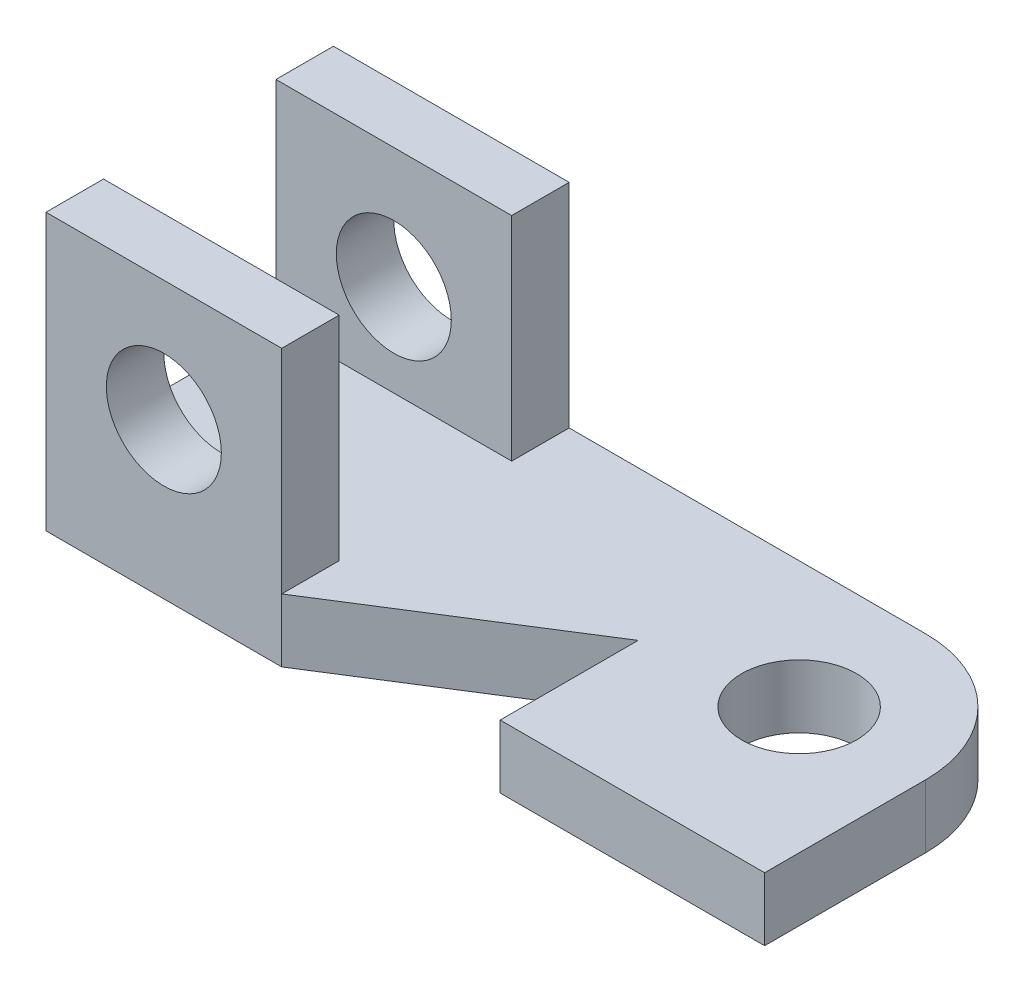
ISO-10303-21;
HEADER;
FILE_DESCRIPTION(('STEP AP214'),'2;1');
FILE_NAME('part.step','',(''),(''),'','','');
FILE_SCHEMA(('AUTOMOTIVE_DESIGN { 1 0 10303 214 1 1 1 1 }'));
ENDSEC;
DATA;
#1=APPLICATION_CONTEXT('core data for automotive mechanical design processes');
#2=APPLICATION_PROTOCOL_DEFINITION('international standard','automotive_design',2000,#1);
#3=PRODUCT_CONTEXT('',#1,'mechanical');
#4=PRODUCT('Part','Part','',(#3));
#5=PRODUCT_RELATED_PRODUCT_CATEGORY('part','',(#4));
#6=PRODUCT_DEFINITION_FORMATION('','',#4);
#7=PRODUCT_DEFINITION_CONTEXT('part definition',#1,'design');
#8=PRODUCT_DEFINITION('design','',#6,#7);
#9=PRODUCT_DEFINITION_SHAPE('','',#8);
#10=(LENGTH_UNIT() NAMED_UNIT(*) SI_UNIT(.MILLI.,.METRE.));
#11=(NAMED_UNIT(*) PLANE_ANGLE_UNIT() SI_UNIT($,.RADIAN.));
#12=(NAMED_UNIT(*) SI_UNIT($,.STERADIAN.) SOLID_ANGLE_UNIT());
#13=UNCERTAINTY_MEASURE_WITH_UNIT(LENGTH_MEASURE(1.E-05),#10,'distance_accuracy_value','');
#14=(GEOMETRIC_REPRESENTATION_CONTEXT(3) GLOBAL_UNCERTAINTY_ASSIGNED_CONTEXT((#13)) GLOBAL_UNIT_ASSIGNED_CONTEXT((#10,
#11,#12)) REPRESENTATION_CONTEXT('',''));
#15=CARTESIAN_POINT('',(0.,0.,0.));
#16=DIRECTION('',(0.,0.,1.));
#17=DIRECTION('',(1.,0.,0.));
#18=AXIS2_PLACEMENT_3D('',#15,#16,#17);
#19=CARTESIAN_POINT('',(-220.,110.,-280.));
#20=DIRECTION('',(0.,-1.,0.));
#21=DIRECTION('',(0.,0.,-1.));
#22=AXIS2_PLACEMENT_3D('',#19,#20,#21);
#23=PLANE('',#22);
#24=CARTESIAN_POINT('',(-220.,110.,-280.));
#25=DIRECTION('',(0.,1.,0.));
#26=DIRECTION('',(0.,0.,1.));
#27=AXIS2_PLACEMENT_3D('',#24,#25,#26);
#28=CIRCLE('',#27,100.);
#29=CARTESIAN_POINT('',(-220.,110.,-180.));
#30=VERTEX_POINT('',#29);
#31=EDGE_CURVE('E221',#30,#30,#28,.T.);
#32=ORIENTED_EDGE('',*,*,#31,.F.);
#33=EDGE_LOOP('',(#32));
#34=FACE_BOUND('',#33,.T.);
#35=DIRECTION('',(1.,0.,0.));
#36=VECTOR('',#35,1.);
#37=CARTESIAN_POINT('',(0.,110.,-99.9999999999999));
#38=LINE('',#37,#36);
#39=CARTESIAN_POINT('',(-1250.,110.,-99.9999999999999));
#40=VERTEX_POINT('',#39);
#41=CARTESIAN_POINT('',(-840.,110.,-99.9999999999999));
#42=VERTEX_POINT('',#41);
#43=EDGE_CURVE('E183',#40,#42,#38,.T.);
#44=ORIENTED_EDGE('',*,*,#43,.T.);
#45=DIRECTION('',(0.,0.,1.));
#46=VECTOR('',#45,1.);
#47=CARTESIAN_POINT('',(-840.,110.,0.));
#48=LINE('',#47,#46);
#49=CARTESIAN_POINT('',(-840.,110.,1.66533453693773E-13));
#50=VERTEX_POINT('',#49);
#51=EDGE_CURVE('E167',#42,#50,#48,.T.);
#52=ORIENTED_EDGE('',*,*,#51,.T.);
#53=DIRECTION('',(-0.845488903030971,0.,0.533992991387982));
#54=VECTOR('',#53,1.);
#55=CARTESIAN_POINT('',(-460.,110.,-240.));
#56=LINE('',#55,#54);
#57=CARTESIAN_POINT('',(-460.,110.,-240.));
#58=VERTEX_POINT('',#57);
#59=EDGE_CURVE('E234',#58,#50,#56,.T.);
#60=ORIENTED_EDGE('',*,*,#59,.F.);
#61=DIRECTION('',(0.,0.,-1.));
#62=VECTOR('',#61,1.);
#63=CARTESIAN_POINT('',(-460.,110.,0.));
#64=LINE('',#63,#62);
#65=CARTESIAN_POINT('',(-460.,110.,0.));
#66=VERTEX_POINT('',#65);
#67=EDGE_CURVE('E230',#66,#58,#64,.T.);
#68=ORIENTED_EDGE('',*,*,#67,.F.);
#69=DIRECTION('',(-1.,0.,0.));
#70=VECTOR('',#69,1.);
#71=CARTESIAN_POINT('',(0.,110.,0.));
#72=LINE('',#71,#70);
#73=CARTESIAN_POINT('',(0.,110.,0.));
#74=VERTEX_POINT('',#73);
#75=EDGE_CURVE('E227',#74,#66,#72,.T.);
#76=ORIENTED_EDGE('',*,*,#75,.F.);
#77=DIRECTION('',(0.,0.,-1.));
#78=VECTOR('',#77,1.);
#79=CARTESIAN_POINT('',(0.,110.,0.));
#80=LINE('',#79,#78);
#81=CARTESIAN_POINT('',(0.,110.,-280.));
#82=VERTEX_POINT('',#81);
#83=EDGE_CURVE('E243',#74,#82,#80,.T.);
#84=ORIENTED_EDGE('',*,*,#83,.T.);
#85=CARTESIAN_POINT('',(-220.,110.,-280.));
#86=DIRECTION('',(0.,-1.,0.));
#87=DIRECTION('',(0.,0.,-1.));
#88=AXIS2_PLACEMENT_3D('',#85,#86,#87);
#89=CIRCLE('',#88,220.);
#90=CARTESIAN_POINT('',(-220.,110.,-500.));
#91=VERTEX_POINT('',#90);
#92=EDGE_CURVE('E240',#91,#82,#89,.T.);
#93=ORIENTED_EDGE('',*,*,#92,.F.);
#94=DIRECTION('',(-1.,0.,0.));
#95=VECTOR('',#94,1.);
#96=CARTESIAN_POINT('',(-220.,110.,-500.));
#97=LINE('',#96,#95);
#98=CARTESIAN_POINT('',(-840.,110.,-500.));
#99=VERTEX_POINT('',#98);
#100=EDGE_CURVE('E238',#91,#99,#97,.T.);
#101=ORIENTED_EDGE('',*,*,#100,.T.);
#102=DIRECTION('',(0.,0.,-1.));
#103=VECTOR('',#102,1.);
#104=CARTESIAN_POINT('',(-840.,110.,0.));
#105=LINE('',#104,#103);
#106=CARTESIAN_POINT('',(-840.,110.,-400.));
#107=VERTEX_POINT('',#106);
#108=EDGE_CURVE('E79',#107,#99,#105,.T.);
#109=ORIENTED_EDGE('',*,*,#108,.F.);
#110=DIRECTION('',(1.,0.,0.));
#111=VECTOR('',#110,1.);
#112=CARTESIAN_POINT('',(0.,110.,-400.));
#113=LINE('',#112,#111);
#114=CARTESIAN_POINT('',(-1250.,110.,-400.));
#115=VERTEX_POINT('',#114);
#116=EDGE_CURVE('E172',#115,#107,#113,.T.);
#117=ORIENTED_EDGE('',*,*,#116,.F.);
#118=DIRECTION('',(0.,0.,-1.));
#119=VECTOR('',#118,1.);
#120=CARTESIAN_POINT('',(-1250.,110.,1.53080849893419E-13));
#121=LINE('',#120,#119);
#122=EDGE_CURVE('E87',#40,#115,#121,.T.);
#123=ORIENTED_EDGE('',*,*,#122,.F.);
#124=EDGE_LOOP('',(#44,#52,#60,#68,#76,#84,#93,#101,#109,#117,#123));
#125=FACE_BOUND('',#124,.T.);
#126=ADVANCED_FACE('F62',(#34,#125),#23,.F.);
#127=CARTESIAN_POINT('',(-220.,0.,-280.));
#128=DIRECTION('',(0.,-1.,0.));
#129=DIRECTION('',(0.,0.,-1.));
#130=AXIS2_PLACEMENT_3D('',#127,#128,#129);
#131=PLANE('',#130);
#132=DIRECTION('',(-1.,0.,0.));
#133=VECTOR('',#132,1.);
#134=CARTESIAN_POINT('',(0.,0.,0.));
#135=LINE('',#134,#133);
#136=CARTESIAN_POINT('',(0.,0.,0.));
#137=VERTEX_POINT('',#136);
#138=CARTESIAN_POINT('',(-460.,0.,0.));
#139=VERTEX_POINT('',#138);
#140=EDGE_CURVE('E224',#137,#139,#135,.T.);
#141=ORIENTED_EDGE('',*,*,#140,.T.);
#142=DIRECTION('',(0.,0.,-1.));
#143=VECTOR('',#142,1.);
#144=CARTESIAN_POINT('',(-460.,0.,0.));
#145=LINE('',#144,#143);
#146=CARTESIAN_POINT('',(-460.,0.,-240.));
#147=VERTEX_POINT('',#146);
#148=EDGE_CURVE('E248',#139,#147,#145,.T.);
#149=ORIENTED_EDGE('',*,*,#148,.T.);
#150=DIRECTION('',(-0.845488903030971,0.,0.533992991387982));
#151=VECTOR('',#150,1.);
#152=CARTESIAN_POINT('',(-460.,0.,-240.));
#153=LINE('',#152,#151);
#154=CARTESIAN_POINT('',(-840.,0.,1.02870331128378E-13));
#155=VERTEX_POINT('',#154);
#156=EDGE_CURVE('E251',#147,#155,#153,.T.);
#157=ORIENTED_EDGE('',*,*,#156,.T.);
#158=DIRECTION('',(-1.,0.,0.));
#159=VECTOR('',#158,1.);
#160=CARTESIAN_POINT('',(-840.,0.,1.02870331128378E-13));
#161=LINE('',#160,#159);
#162=CARTESIAN_POINT('',(-1250.,0.,1.53080849893419E-13));
#163=VERTEX_POINT('',#162);
#164=EDGE_CURVE('E254',#155,#163,#161,.T.);
#165=ORIENTED_EDGE('',*,*,#164,.T.);
#166=DIRECTION('',(0.,0.,-1.));
#167=VECTOR('',#166,1.);
#168=CARTESIAN_POINT('',(-1250.,0.,1.53080849893419E-13));
#169=LINE('',#168,#167);
#170=CARTESIAN_POINT('',(-1250.,0.,-500.));
#171=VERTEX_POINT('',#170);
#172=EDGE_CURVE('E257',#163,#171,#169,.T.);
#173=ORIENTED_EDGE('',*,*,#172,.T.);
#174=DIRECTION('',(-1.,0.,0.));
#175=VECTOR('',#174,1.);
#176=CARTESIAN_POINT('',(-220.,0.,-500.));
#177=LINE('',#176,#175);
#178=CARTESIAN_POINT('',(-220.,0.,-500.));
#179=VERTEX_POINT('',#178);
#180=EDGE_CURVE('E260',#179,#171,#177,.T.);
#181=ORIENTED_EDGE('',*,*,#180,.F.);
#182=CARTESIAN_POINT('',(-220.,0.,-280.));
#183=DIRECTION('',(0.,-1.,0.));
#184=DIRECTION('',(0.,0.,-1.));
#185=AXIS2_PLACEMENT_3D('',#182,#183,#184);
#186=CIRCLE('',#185,220.);
#187=CARTESIAN_POINT('',(0.,0.,-280.));
#188=VERTEX_POINT('',#187);
#189=EDGE_CURVE('E263',#179,#188,#186,.T.);
#190=ORIENTED_EDGE('',*,*,#189,.T.);
#191=DIRECTION('',(0.,0.,-1.));
#192=VECTOR('',#191,1.);
#193=CARTESIAN_POINT('',(0.,0.,0.));
#194=LINE('',#193,#192);
#195=EDGE_CURVE('E231',#137,#188,#194,.T.);
#196=ORIENTED_EDGE('',*,*,#195,.F.);
#197=EDGE_LOOP('',(#141,#149,#157,#165,#173,#181,#190,#196));
#198=FACE_BOUND('',#197,.T.);
#199=CARTESIAN_POINT('',(-220.,0.,-280.));
#200=DIRECTION('',(0.,1.,0.));
#201=DIRECTION('',(0.,0.,1.));
#202=AXIS2_PLACEMENT_3D('',#199,#200,#201);
#203=CIRCLE('',#202,100.);
#204=CARTESIAN_POINT('',(-220.,0.,-180.));
#205=VERTEX_POINT('',#204);
#206=EDGE_CURVE('E220',#205,#205,#203,.T.);
#207=ORIENTED_EDGE('',*,*,#206,.T.);
#208=EDGE_LOOP('',(#207));
#209=FACE_BOUND('',#208,.T.);
#210=ADVANCED_FACE('F288',(#198,#209),#131,.T.);
#211=CARTESIAN_POINT('',(0.,110.,0.));
#212=DIRECTION('',(0.,0.,1.));
#213=DIRECTION('',(1.,0.,0.));
#214=AXIS2_PLACEMENT_3D('',#211,#212,#213);
#215=PLANE('',#214);
#216=ORIENTED_EDGE('',*,*,#140,.F.);
#217=DIRECTION('',(0.,-1.,0.));
#218=VECTOR('',#217,1.);
#219=CARTESIAN_POINT('',(0.,110.,0.));
#220=LINE('',#219,#218);
#221=EDGE_CURVE('E12',#74,#137,#220,.T.);
#222=ORIENTED_EDGE('',*,*,#221,.F.);
#223=ORIENTED_EDGE('',*,*,#75,.T.);
#224=DIRECTION('',(0.,-1.,0.));
#225=VECTOR('',#224,1.);
#226=CARTESIAN_POINT('',(-460.,110.,0.));
#227=LINE('',#226,#225);
#228=EDGE_CURVE('E245',#66,#139,#227,.T.);
#229=ORIENTED_EDGE('',*,*,#228,.T.);
#230=EDGE_LOOP('',(#216,#222,#223,#229));
#231=FACE_BOUND('',#230,.T.);
#232=ADVANCED_FACE('F64',(#231),#215,.T.);
#233=CARTESIAN_POINT('',(0.,110.,0.));
#234=DIRECTION('',(-1.,0.,0.));
#235=DIRECTION('',(0.,0.,1.));
#236=AXIS2_PLACEMENT_3D('',#233,#234,#235);
#237=PLANE('',#236);
#238=ORIENTED_EDGE('',*,*,#195,.T.);
#239=DIRECTION('',(0.,-1.,0.));
#240=VECTOR('',#239,1.);
#241=CARTESIAN_POINT('',(0.,110.,-280.));
#242=LINE('',#241,#240);
#243=EDGE_CURVE('E71',#82,#188,#242,.T.);
#244=ORIENTED_EDGE('',*,*,#243,.F.);
#245=ORIENTED_EDGE('',*,*,#83,.F.);
#246=ORIENTED_EDGE('',*,*,#221,.T.);
#247=EDGE_LOOP('',(#238,#244,#245,#246));
#248=FACE_BOUND('',#247,.T.);
#249=ADVANCED_FACE('F294',(#248),#237,.F.);
#250=CARTESIAN_POINT('',(-220.,110.,-280.));
#251=DIRECTION('',(0.,-1.,0.));
#252=DIRECTION('',(0.,0.,-1.));
#253=AXIS2_PLACEMENT_3D('',#250,#251,#252);
#254=CYLINDRICAL_SURFACE('',#253,220.);
#255=ORIENTED_EDGE('',*,*,#189,.F.);
#256=DIRECTION('',(0.,-1.,0.));
#257=VECTOR('',#256,1.);
#258=CARTESIAN_POINT('',(-220.,110.,-500.));
#259=LINE('',#258,#257);
#260=EDGE_CURVE('E269',#91,#179,#259,.T.);
#261=ORIENTED_EDGE('',*,*,#260,.F.);
#262=ORIENTED_EDGE('',*,*,#92,.T.);
#263=ORIENTED_EDGE('',*,*,#243,.T.);
#264=EDGE_LOOP('',(#255,#261,#262,#263));
#265=FACE_BOUND('',#264,.T.);
#266=ADVANCED_FACE('F312',(#265),#254,.T.);
#267=CARTESIAN_POINT('',(-220.,110.,-500.));
#268=DIRECTION('',(0.,0.,1.));
#269=DIRECTION('',(1.,0.,0.));
#270=AXIS2_PLACEMENT_3D('',#267,#268,#269);
#271=PLANE('',#270);
#272=CARTESIAN_POINT('',(-1045.,270.,-500.));
#273=DIRECTION('',(0.,0.,1.));
#274=DIRECTION('',(1.,0.,0.));
#275=AXIS2_PLACEMENT_3D('',#272,#273,#274);
#276=CIRCLE('',#275,100.);
#277=CARTESIAN_POINT('',(-945.,270.,-500.));
#278=VERTEX_POINT('',#277);
#279=EDGE_CURVE('E464',#278,#278,#276,.T.);
#280=ORIENTED_EDGE('',*,*,#279,.T.);
#281=EDGE_LOOP('',(#280));
#282=FACE_BOUND('',#281,.T.);
#283=ORIENTED_EDGE('',*,*,#180,.T.);
#284=DIRECTION('',(0.,-1.,0.));
#285=VECTOR('',#284,1.);
#286=CARTESIAN_POINT('',(-1250.,110.,-500.));
#287=LINE('',#286,#285);
#288=CARTESIAN_POINT('',(-1250.,480.,-500.));
#289=VERTEX_POINT('',#288);
#290=EDGE_CURVE('E271',#289,#171,#287,.T.);
#291=ORIENTED_EDGE('',*,*,#290,.F.);
#292=DIRECTION('',(-1.,0.,0.));
#293=VECTOR('',#292,1.);
#294=CARTESIAN_POINT('',(0.,480.,-500.));
#295=LINE('',#294,#293);
#296=CARTESIAN_POINT('',(-840.,480.,-500.));
#297=VERTEX_POINT('',#296);
#298=EDGE_CURVE('E204',#297,#289,#295,.T.);
#299=ORIENTED_EDGE('',*,*,#298,.F.);
#300=DIRECTION('',(0.,-1.,0.));
#301=VECTOR('',#300,1.);
#302=CARTESIAN_POINT('',(-840.,480.,-500.));
#303=LINE('',#302,#301);
#304=EDGE_CURVE('E215',#297,#99,#303,.T.);
#305=ORIENTED_EDGE('',*,*,#304,.T.);
#306=ORIENTED_EDGE('',*,*,#100,.F.);
#307=ORIENTED_EDGE('',*,*,#260,.T.);
#308=EDGE_LOOP('',(#283,#291,#299,#305,#306,#307));
#309=FACE_BOUND('',#308,.T.);
#310=ADVANCED_FACE('F309',(#282,#309),#271,.F.);
#311=CARTESIAN_POINT('',(-1250.,110.,1.53080849893419E-13));
#312=DIRECTION('',(-1.,0.,0.));
#313=DIRECTION('',(0.,0.,1.));
#314=AXIS2_PLACEMENT_3D('',#311,#312,#313);
#315=PLANE('',#314);
#316=ORIENTED_EDGE('',*,*,#172,.F.);
#317=DIRECTION('',(0.,-1.,0.));
#318=VECTOR('',#317,1.);
#319=CARTESIAN_POINT('',(-1250.,110.,1.53080849893419E-13));
#320=LINE('',#319,#318);
#321=CARTESIAN_POINT('',(-1250.,480.,1.53080849893419E-13));
#322=VERTEX_POINT('',#321);
#323=EDGE_CURVE('E273',#322,#163,#320,.T.);
#324=ORIENTED_EDGE('',*,*,#323,.F.);
#325=DIRECTION('',(0.,0.,1.));
#326=VECTOR('',#325,1.);
#327=CARTESIAN_POINT('',(-1250.,480.,0.));
#328=LINE('',#327,#326);
#329=CARTESIAN_POINT('',(-1250.,480.,-99.9999999999999));
#330=VERTEX_POINT('',#329);
#331=EDGE_CURVE('E187',#330,#322,#328,.T.);
#332=ORIENTED_EDGE('',*,*,#331,.F.);
#333=DIRECTION('',(0.,-1.,0.));
#334=VECTOR('',#333,1.);
#335=CARTESIAN_POINT('',(-1250.,480.,-99.9999999999999));
#336=LINE('',#335,#334);
#337=EDGE_CURVE('E173',#330,#40,#336,.T.);
#338=ORIENTED_EDGE('',*,*,#337,.T.);
#339=ORIENTED_EDGE('',*,*,#122,.T.);
#340=DIRECTION('',(0.,-1.,0.));
#341=VECTOR('',#340,1.);
#342=CARTESIAN_POINT('',(-1250.,480.,-400.));
#343=LINE('',#342,#341);
#344=CARTESIAN_POINT('',(-1250.,480.,-400.));
#345=VERTEX_POINT('',#344);
#346=EDGE_CURVE('E209',#345,#115,#343,.T.);
#347=ORIENTED_EDGE('',*,*,#346,.F.);
#348=DIRECTION('',(0.,0.,1.));
#349=VECTOR('',#348,1.);
#350=CARTESIAN_POINT('',(-1250.,480.,0.));
#351=LINE('',#350,#349);
#352=EDGE_CURVE('E207',#289,#345,#351,.T.);
#353=ORIENTED_EDGE('',*,*,#352,.F.);
#354=ORIENTED_EDGE('',*,*,#290,.T.);
#355=EDGE_LOOP('',(#316,#324,#332,#338,#339,#347,#353,#354));
#356=FACE_BOUND('',#355,.T.);
#357=ADVANCED_FACE('F305',(#356),#315,.T.);
#358=CARTESIAN_POINT('',(-840.,110.,1.02870331128378E-13));
#359=DIRECTION('',(0.,0.,1.));
#360=DIRECTION('',(1.,0.,0.));
#361=AXIS2_PLACEMENT_3D('',#358,#359,#360);
#362=PLANE('',#361);
#363=CARTESIAN_POINT('',(-1045.,270.,0.));
#364=DIRECTION('',(0.,0.,1.));
#365=DIRECTION('',(1.,0.,0.));
#366=AXIS2_PLACEMENT_3D('',#363,#364,#365);
#367=CIRCLE('',#366,100.);
#368=CARTESIAN_POINT('',(-945.,270.,0.));
#369=VERTEX_POINT('',#368);
#370=EDGE_CURVE('E468',#369,#369,#367,.T.);
#371=ORIENTED_EDGE('',*,*,#370,.F.);
#372=EDGE_LOOP('',(#371));
#373=FACE_BOUND('',#372,.T.);
#374=ORIENTED_EDGE('',*,*,#164,.F.);
#375=DIRECTION('',(0.,-1.,0.));
#376=VECTOR('',#375,1.);
#377=CARTESIAN_POINT('',(-840.,110.,1.02870331128378E-13));
#378=LINE('',#377,#376);
#379=EDGE_CURVE('E275',#50,#155,#378,.T.);
#380=ORIENTED_EDGE('',*,*,#379,.F.);
#381=DIRECTION('',(0.,-1.,0.));
#382=VECTOR('',#381,1.);
#383=CARTESIAN_POINT('',(-840.,480.,1.66533453693773E-13));
#384=LINE('',#383,#382);
#385=CARTESIAN_POINT('',(-840.,480.,1.66533453693773E-13));
#386=VERTEX_POINT('',#385);
#387=EDGE_CURVE('E193',#386,#50,#384,.T.);
#388=ORIENTED_EDGE('',*,*,#387,.F.);
#389=DIRECTION('',(1.,0.,0.));
#390=VECTOR('',#389,1.);
#391=CARTESIAN_POINT('',(0.,480.,0.));
#392=LINE('',#391,#390);
#393=EDGE_CURVE('E181',#322,#386,#392,.T.);
#394=ORIENTED_EDGE('',*,*,#393,.F.);
#395=ORIENTED_EDGE('',*,*,#323,.T.);
#396=EDGE_LOOP('',(#374,#380,#388,#394,#395));
#397=FACE_BOUND('',#396,.T.);
#398=ADVANCED_FACE('F304',(#373,#397),#362,.T.);
#399=CARTESIAN_POINT('',(-460.,110.,-240.));
#400=DIRECTION('',(0.533992991387982,0.,0.845488903030971));
#401=DIRECTION('',(0.845488903030971,0.,-0.533992991387982));
#402=AXIS2_PLACEMENT_3D('',#399,#400,#401);
#403=PLANE('',#402);
#404=ORIENTED_EDGE('',*,*,#156,.F.);
#405=DIRECTION('',(0.,-1.,0.));
#406=VECTOR('',#405,1.);
#407=CARTESIAN_POINT('',(-460.,110.,-240.));
#408=LINE('',#407,#406);
#409=EDGE_CURVE('E277',#58,#147,#408,.T.);
#410=ORIENTED_EDGE('',*,*,#409,.F.);
#411=ORIENTED_EDGE('',*,*,#59,.T.);
#412=ORIENTED_EDGE('',*,*,#379,.T.);
#413=EDGE_LOOP('',(#404,#410,#411,#412));
#414=FACE_BOUND('',#413,.T.);
#415=ADVANCED_FACE('F300',(#414),#403,.T.);
#416=CARTESIAN_POINT('',(-460.,110.,0.));
#417=DIRECTION('',(-1.,0.,0.));
#418=DIRECTION('',(0.,0.,1.));
#419=AXIS2_PLACEMENT_3D('',#416,#417,#418);
#420=PLANE('',#419);
#421=ORIENTED_EDGE('',*,*,#148,.F.);
#422=ORIENTED_EDGE('',*,*,#228,.F.);
#423=ORIENTED_EDGE('',*,*,#67,.T.);
#424=ORIENTED_EDGE('',*,*,#409,.T.);
#425=EDGE_LOOP('',(#421,#422,#423,#424));
#426=FACE_BOUND('',#425,.T.);
#427=ADVANCED_FACE('F284',(#426),#420,.T.);
#428=CARTESIAN_POINT('',(-220.,110.,-280.));
#429=DIRECTION('',(0.,-1.,0.));
#430=DIRECTION('',(0.,0.,-1.));
#431=AXIS2_PLACEMENT_3D('',#428,#429,#430);
#432=CYLINDRICAL_SURFACE('',#431,100.);
#433=ORIENTED_EDGE('',*,*,#31,.T.);
#434=EDGE_LOOP('',(#433));
#435=FACE_BOUND('',#434,.T.);
#436=ORIENTED_EDGE('',*,*,#206,.F.);
#437=EDGE_LOOP('',(#436));
#438=FACE_BOUND('',#437,.T.);
#439=ADVANCED_FACE('F323',(#435,#438),#432,.F.);
#440=CARTESIAN_POINT('',(0.,480.,-400.));
#441=DIRECTION('',(0.,0.,-1.));
#442=DIRECTION('',(-1.,0.,0.));
#443=AXIS2_PLACEMENT_3D('',#440,#441,#442);
#444=PLANE('',#443);
#445=CARTESIAN_POINT('',(-1045.,270.,-400.));
#446=DIRECTION('',(0.,0.,-1.));
#447=DIRECTION('',(-1.,0.,0.));
#448=AXIS2_PLACEMENT_3D('',#445,#446,#447);
#449=CIRCLE('',#448,100.);
#450=CARTESIAN_POINT('',(-1145.,270.,-400.));
#451=VERTEX_POINT('',#450);
#452=EDGE_CURVE('E195',#451,#451,#449,.T.);
#453=ORIENTED_EDGE('',*,*,#452,.T.);
#454=EDGE_LOOP('',(#453));
#455=FACE_BOUND('',#454,.T.);
#456=ORIENTED_EDGE('',*,*,#116,.T.);
#457=DIRECTION('',(0.,-1.,0.));
#458=VECTOR('',#457,1.);
#459=CARTESIAN_POINT('',(-840.,480.,-400.));
#460=LINE('',#459,#458);
#461=CARTESIAN_POINT('',(-840.,480.,-400.));
#462=VERTEX_POINT('',#461);
#463=EDGE_CURVE('E218',#462,#107,#460,.T.);
#464=ORIENTED_EDGE('',*,*,#463,.F.);
#465=DIRECTION('',(1.,0.,0.));
#466=VECTOR('',#465,1.);
#467=CARTESIAN_POINT('',(0.,480.,-400.));
#468=LINE('',#467,#466);
#469=EDGE_CURVE('E199',#345,#462,#468,.T.);
#470=ORIENTED_EDGE('',*,*,#469,.F.);
#471=ORIENTED_EDGE('',*,*,#346,.T.);
#472=EDGE_LOOP('',(#456,#464,#470,#471));
#473=FACE_BOUND('',#472,.T.);
#474=ADVANCED_FACE('F321',(#455,#473),#444,.F.);
#475=CARTESIAN_POINT('',(-840.,480.,0.));
#476=DIRECTION('',(-1.,0.,0.));
#477=DIRECTION('',(0.,0.,1.));
#478=AXIS2_PLACEMENT_3D('',#475,#476,#477);
#479=PLANE('',#478);
#480=ORIENTED_EDGE('',*,*,#108,.T.);
#481=ORIENTED_EDGE('',*,*,#304,.F.);
#482=DIRECTION('',(0.,0.,-1.));
#483=VECTOR('',#482,1.);
#484=CARTESIAN_POINT('',(-840.,480.,0.));
#485=LINE('',#484,#483);
#486=EDGE_CURVE('E202',#462,#297,#485,.T.);
#487=ORIENTED_EDGE('',*,*,#486,.F.);
#488=ORIENTED_EDGE('',*,*,#463,.T.);
#489=EDGE_LOOP('',(#480,#481,#487,#488));
#490=FACE_BOUND('',#489,.T.);
#491=ADVANCED_FACE('F315',(#490),#479,.F.);
#492=CARTESIAN_POINT('',(0.,480.,0.));
#493=DIRECTION('',(0.,1.,0.));
#494=DIRECTION('',(0.,0.,1.));
#495=AXIS2_PLACEMENT_3D('',#492,#493,#494);
#496=PLANE('',#495);
#497=ORIENTED_EDGE('',*,*,#469,.T.);
#498=ORIENTED_EDGE('',*,*,#486,.T.);
#499=ORIENTED_EDGE('',*,*,#298,.T.);
#500=ORIENTED_EDGE('',*,*,#352,.T.);
#501=EDGE_LOOP('',(#497,#498,#499,#500));
#502=FACE_BOUND('',#501,.T.);
#503=ADVANCED_FACE('F318',(#502),#496,.T.);
#504=CARTESIAN_POINT('',(-840.,480.,0.));
#505=DIRECTION('',(1.,0.,0.));
#506=DIRECTION('',(0.,0.,-1.));
#507=AXIS2_PLACEMENT_3D('',#504,#505,#506);
#508=PLANE('',#507);
#509=ORIENTED_EDGE('',*,*,#51,.F.);
#510=DIRECTION('',(0.,-1.,0.));
#511=VECTOR('',#510,1.);
#512=CARTESIAN_POINT('',(-840.,480.,-99.9999999999999));
#513=LINE('',#512,#511);
#514=CARTESIAN_POINT('',(-840.,480.,-99.9999999999999));
#515=VERTEX_POINT('',#514);
#516=EDGE_CURVE('E162',#515,#42,#513,.T.);
#517=ORIENTED_EDGE('',*,*,#516,.F.);
#518=DIRECTION('',(0.,0.,1.));
#519=VECTOR('',#518,1.);
#520=CARTESIAN_POINT('',(-840.,480.,0.));
#521=LINE('',#520,#519);
#522=EDGE_CURVE('E165',#515,#386,#521,.T.);
#523=ORIENTED_EDGE('',*,*,#522,.T.);
#524=ORIENTED_EDGE('',*,*,#387,.T.);
#525=EDGE_LOOP('',(#509,#517,#523,#524));
#526=FACE_BOUND('',#525,.T.);
#527=ADVANCED_FACE('F164',(#526),#508,.T.);
#528=CARTESIAN_POINT('',(0.,480.,-99.9999999999999));
#529=DIRECTION('',(0.,0.,-1.));
#530=DIRECTION('',(-1.,0.,0.));
#531=AXIS2_PLACEMENT_3D('',#528,#529,#530);
#532=PLANE('',#531);
#533=CARTESIAN_POINT('',(-1045.,270.,-99.9999999999999));
#534=DIRECTION('',(0.,0.,-1.));
#535=DIRECTION('',(-1.,0.,0.));
#536=AXIS2_PLACEMENT_3D('',#533,#534,#535);
#537=CIRCLE('',#536,100.);
#538=CARTESIAN_POINT('',(-1145.,270.,-99.9999999999999));
#539=VERTEX_POINT('',#538);
#540=EDGE_CURVE('E66',#539,#539,#537,.T.);
#541=ORIENTED_EDGE('',*,*,#540,.F.);
#542=EDGE_LOOP('',(#541));
#543=FACE_BOUND('',#542,.T.);
#544=ORIENTED_EDGE('',*,*,#43,.F.);
#545=ORIENTED_EDGE('',*,*,#337,.F.);
#546=DIRECTION('',(1.,0.,0.));
#547=VECTOR('',#546,1.);
#548=CARTESIAN_POINT('',(0.,480.,-99.9999999999999));
#549=LINE('',#548,#547);
#550=EDGE_CURVE('E179',#330,#515,#549,.T.);
#551=ORIENTED_EDGE('',*,*,#550,.T.);
#552=ORIENTED_EDGE('',*,*,#516,.T.);
#553=EDGE_LOOP('',(#544,#545,#551,#552));
#554=FACE_BOUND('',#553,.T.);
#555=ADVANCED_FACE('F185',(#543,#554),#532,.T.);
#556=CARTESIAN_POINT('',(0.,480.,0.));
#557=DIRECTION('',(0.,1.,0.));
#558=DIRECTION('',(0.,0.,1.));
#559=AXIS2_PLACEMENT_3D('',#556,#557,#558);
#560=PLANE('',#559);
#561=ORIENTED_EDGE('',*,*,#522,.F.);
#562=ORIENTED_EDGE('',*,*,#550,.F.);
#563=ORIENTED_EDGE('',*,*,#331,.T.);
#564=ORIENTED_EDGE('',*,*,#393,.T.);
#565=EDGE_LOOP('',(#561,#562,#563,#564));
#566=FACE_BOUND('',#565,.T.);
#567=ADVANCED_FACE('F177',(#566),#560,.T.);
#568=CARTESIAN_POINT('',(-1045.,270.,-500.));
#569=DIRECTION('',(0.,0.,1.));
#570=DIRECTION('',(1.,0.,0.));
#571=AXIS2_PLACEMENT_3D('',#568,#569,#570);
#572=CYLINDRICAL_SURFACE('',#571,100.);
#573=ORIENTED_EDGE('',*,*,#540,.T.);
#574=EDGE_LOOP('',(#573));
#575=FACE_BOUND('',#574,.T.);
#576=ORIENTED_EDGE('',*,*,#370,.T.);
#577=EDGE_LOOP('',(#576));
#578=FACE_BOUND('',#577,.T.);
#579=ADVANCED_FACE('F418',(#575,#578),#572,.F.);
#580=ORIENTED_EDGE('',*,*,#279,.F.);
#581=EDGE_LOOP('',(#580));
#582=FACE_BOUND('',#581,.T.);
#583=ORIENTED_EDGE('',*,*,#452,.F.);
#584=EDGE_LOOP('',(#583));
#585=FACE_BOUND('',#584,.T.);
#586=ADVANCED_FACE('F448',(#582,#585),#572,.F.);
#587=CLOSED_SHELL('',(#126,#210,#232,#249,#266,#310,#357,#398,#415,#427,#439,#474,#491,#503,
#527,#555,#567,#579,#586));
#588=MANIFOLD_SOLID_BREP('B2',#587);
#589=ADVANCED_BREP_SHAPE_REPRESENTATION('',(#18,#588),#14);
#590=SHAPE_DEFINITION_REPRESENTATION(#9,#589);
ENDSEC;
END-ISO-10303-21;
